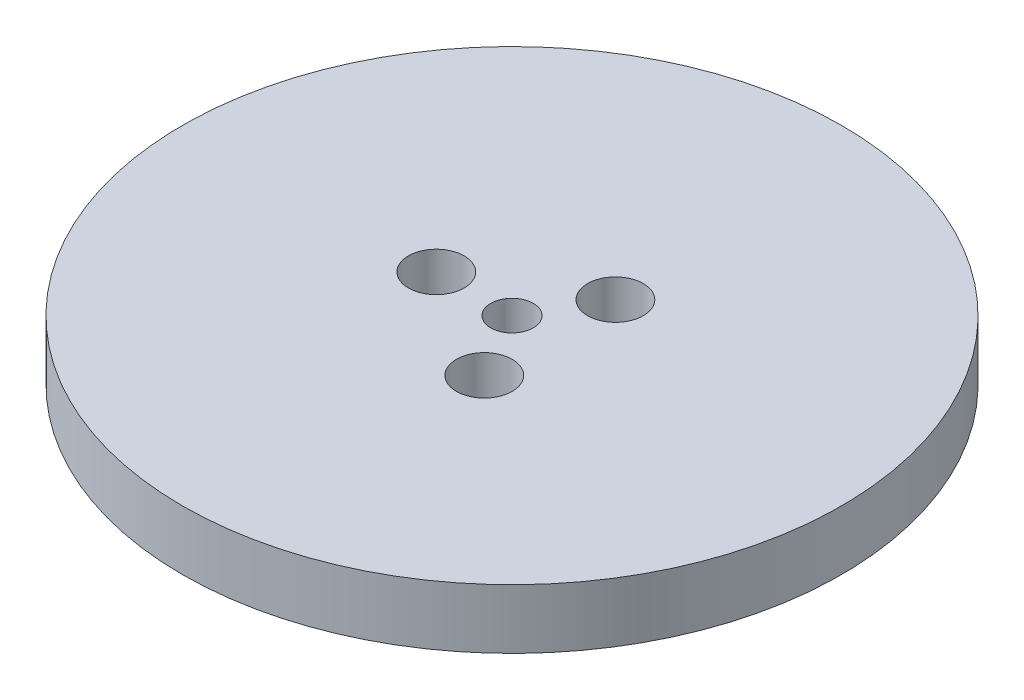
ISO-10303-21;
HEADER;
FILE_DESCRIPTION(('STEP AP214'),'2;1');
FILE_NAME('part.step','',(''),(''),'','','');
FILE_SCHEMA(('AUTOMOTIVE_DESIGN { 1 0 10303 214 1 1 1 1 }'));
ENDSEC;
DATA;
#1=APPLICATION_CONTEXT('core data for automotive mechanical design processes');
#2=APPLICATION_PROTOCOL_DEFINITION('international standard','automotive_design',2000,#1);
#3=PRODUCT_CONTEXT('',#1,'mechanical');
#4=PRODUCT('Part','Part','',(#3));
#5=PRODUCT_RELATED_PRODUCT_CATEGORY('part','',(#4));
#6=PRODUCT_DEFINITION_FORMATION('','',#4);
#7=PRODUCT_DEFINITION_CONTEXT('part definition',#1,'design');
#8=PRODUCT_DEFINITION('design','',#6,#7);
#9=PRODUCT_DEFINITION_SHAPE('','',#8);
#10=(LENGTH_UNIT() NAMED_UNIT(*) SI_UNIT(.MILLI.,.METRE.));
#11=(NAMED_UNIT(*) PLANE_ANGLE_UNIT() SI_UNIT($,.RADIAN.));
#12=(NAMED_UNIT(*) SI_UNIT($,.STERADIAN.) SOLID_ANGLE_UNIT());
#13=UNCERTAINTY_MEASURE_WITH_UNIT(LENGTH_MEASURE(1.E-05),#10,'distance_accuracy_value','');
#14=(GEOMETRIC_REPRESENTATION_CONTEXT(3) GLOBAL_UNCERTAINTY_ASSIGNED_CONTEXT((#13)) GLOBAL_UNIT_ASSIGNED_CONTEXT((#10,
#11,#12)) REPRESENTATION_CONTEXT('',''));
#15=CARTESIAN_POINT('',(0.,0.,0.));
#16=DIRECTION('',(0.,0.,1.));
#17=DIRECTION('',(1.,0.,0.));
#18=AXIS2_PLACEMENT_3D('',#15,#16,#17);
#19=CARTESIAN_POINT('',(0.,14.,0.));
#20=DIRECTION('',(0.,-1.,0.));
#21=DIRECTION('',(0.,0.,-1.));
#22=AXIS2_PLACEMENT_3D('',#19,#20,#21);
#23=CYLINDRICAL_SURFACE('',#22,77.5);
#24=CARTESIAN_POINT('',(0.,14.,0.));
#25=DIRECTION('',(0.,1.,0.));
#26=DIRECTION('',(0.,0.,1.));
#27=AXIS2_PLACEMENT_3D('',#24,#25,#26);
#28=CIRCLE('',#27,77.5);
#29=CARTESIAN_POINT('',(0.,14.,77.5));
#30=VERTEX_POINT('',#29);
#31=EDGE_CURVE('E10',#30,#30,#28,.T.);
#32=ORIENTED_EDGE('',*,*,#31,.F.);
#33=EDGE_LOOP('',(#32));
#34=FACE_BOUND('',#33,.T.);
#35=CARTESIAN_POINT('',(0.,0.,0.));
#36=DIRECTION('',(0.,1.,0.));
#37=DIRECTION('',(0.,0.,1.));
#38=AXIS2_PLACEMENT_3D('',#35,#36,#37);
#39=CIRCLE('',#38,77.5);
#40=CARTESIAN_POINT('',(0.,0.,77.5));
#41=VERTEX_POINT('',#40);
#42=EDGE_CURVE('E37',#41,#41,#39,.T.);
#43=ORIENTED_EDGE('',*,*,#42,.T.);
#44=EDGE_LOOP('',(#43));
#45=FACE_BOUND('',#44,.T.);
#46=ADVANCED_FACE('F40',(#34,#45),#23,.T.);
#47=CARTESIAN_POINT('',(0.,14.,0.));
#48=DIRECTION('',(0.,1.,0.));
#49=DIRECTION('',(0.,0.,1.));
#50=AXIS2_PLACEMENT_3D('',#47,#48,#49);
#51=PLANE('',#50);
#52=CARTESIAN_POINT('',(8.90197339307302,14.,15.4186702044286));
#53=DIRECTION('',(0.,1.,0.));
#54=DIRECTION('',(0.866025403784436,0.,-0.500000000000004));
#55=AXIS2_PLACEMENT_3D('',#52,#53,#54);
#56=CIRCLE('',#55,6.55427380083942);
#57=CARTESIAN_POINT('',(14.5781410079587,14.,12.1415333040089));
#58=VERTEX_POINT('',#57);
#59=EDGE_CURVE('E70',#58,#58,#56,.T.);
#60=ORIENTED_EDGE('',*,*,#59,.F.);
#61=EDGE_LOOP('',(#60));
#62=FACE_BOUND('',#61,.T.);
#63=CARTESIAN_POINT('',(8.9019733930728,14.,-15.4186702044287));
#64=DIRECTION('',(0.,1.,0.));
#65=DIRECTION('',(-0.866025403784443,0.,-0.499999999999992));
#66=AXIS2_PLACEMENT_3D('',#63,#64,#65);
#67=CIRCLE('',#66,6.55427380083942);
#68=CARTESIAN_POINT('',(3.22580577818705,14.,-18.6958071048484));
#69=VERTEX_POINT('',#68);
#70=EDGE_CURVE('E61',#69,#69,#67,.T.);
#71=ORIENTED_EDGE('',*,*,#70,.F.);
#72=EDGE_LOOP('',(#71));
#73=FACE_BOUND('',#72,.T.);
#74=CARTESIAN_POINT('',(-17.8039467861459,14.,0.));
#75=DIRECTION('',(0.,1.,0.));
#76=DIRECTION('',(0.,0.,1.));
#77=AXIS2_PLACEMENT_3D('',#74,#75,#76);
#78=CIRCLE('',#77,6.55427380083942);
#79=CARTESIAN_POINT('',(-17.8039467861459,14.,6.55427380083942));
#80=VERTEX_POINT('',#79);
#81=EDGE_CURVE('E54',#80,#80,#78,.T.);
#82=ORIENTED_EDGE('',*,*,#81,.F.);
#83=EDGE_LOOP('',(#82));
#84=FACE_BOUND('',#83,.T.);
#85=CARTESIAN_POINT('',(0.,14.,0.));
#86=DIRECTION('',(0.,1.,0.));
#87=DIRECTION('',(0.,0.,1.));
#88=AXIS2_PLACEMENT_3D('',#85,#86,#87);
#89=CIRCLE('',#88,5.);
#90=CARTESIAN_POINT('',(0.,14.,5.));
#91=VERTEX_POINT('',#90);
#92=EDGE_CURVE('E50',#91,#91,#89,.T.);
#93=ORIENTED_EDGE('',*,*,#92,.F.);
#94=EDGE_LOOP('',(#93));
#95=FACE_BOUND('',#94,.T.);
#96=ORIENTED_EDGE('',*,*,#31,.T.);
#97=EDGE_LOOP('',(#96));
#98=FACE_BOUND('',#97,.T.);
#99=ADVANCED_FACE('F85',(#62,#73,#84,#95,#98),#51,.T.);
#100=CARTESIAN_POINT('',(0.,0.,0.));
#101=DIRECTION('',(0.,1.,0.));
#102=DIRECTION('',(0.,0.,1.));
#103=AXIS2_PLACEMENT_3D('',#100,#101,#102);
#104=PLANE('',#103);
#105=CARTESIAN_POINT('',(0.,0.,0.));
#106=DIRECTION('',(0.,1.,0.));
#107=DIRECTION('',(0.,0.,1.));
#108=AXIS2_PLACEMENT_3D('',#105,#106,#107);
#109=CIRCLE('',#108,5.);
#110=CARTESIAN_POINT('',(0.,0.,5.));
#111=VERTEX_POINT('',#110);
#112=EDGE_CURVE('E47',#111,#111,#109,.T.);
#113=ORIENTED_EDGE('',*,*,#112,.T.);
#114=EDGE_LOOP('',(#113));
#115=FACE_BOUND('',#114,.T.);
#116=ORIENTED_EDGE('',*,*,#42,.F.);
#117=EDGE_LOOP('',(#116));
#118=FACE_BOUND('',#117,.T.);
#119=ADVANCED_FACE('F84',(#115,#118),#104,.F.);
#120=CARTESIAN_POINT('',(0.,14.,0.));
#121=DIRECTION('',(0.,-1.,0.));
#122=DIRECTION('',(0.,0.,-1.));
#123=AXIS2_PLACEMENT_3D('',#120,#121,#122);
#124=CYLINDRICAL_SURFACE('',#123,5.);
#125=ORIENTED_EDGE('',*,*,#92,.T.);
#126=EDGE_LOOP('',(#125));
#127=FACE_BOUND('',#126,.T.);
#128=ORIENTED_EDGE('',*,*,#112,.F.);
#129=EDGE_LOOP('',(#128));
#130=FACE_BOUND('',#129,.T.);
#131=ADVANCED_FACE('F91',(#127,#130),#124,.F.);
#132=CARTESIAN_POINT('',(-17.8039467861459,0.525690304775537,0.));
#133=DIRECTION('',(0.,1.,0.));
#134=DIRECTION('',(0.,0.,1.));
#135=AXIS2_PLACEMENT_3D('',#132,#133,#134);
#136=CYLINDRICAL_SURFACE('',#135,6.55427380083942);
#137=CARTESIAN_POINT('',(-17.8039467861459,0.525690304775537,0.));
#138=DIRECTION('',(0.,1.,0.));
#139=DIRECTION('',(0.,0.,1.));
#140=AXIS2_PLACEMENT_3D('',#137,#138,#139);
#141=CIRCLE('',#140,6.55427380083942);
#142=CARTESIAN_POINT('',(-17.8039467861459,0.525690304775537,6.55427380083942));
#143=VERTEX_POINT('',#142);
#144=EDGE_CURVE('E55',#143,#143,#141,.T.);
#145=ORIENTED_EDGE('',*,*,#144,.F.);
#146=EDGE_LOOP('',(#145));
#147=FACE_BOUND('',#146,.T.);
#148=ORIENTED_EDGE('',*,*,#81,.T.);
#149=EDGE_LOOP('',(#148));
#150=FACE_BOUND('',#149,.T.);
#151=ADVANCED_FACE('F96',(#147,#150),#136,.F.);
#152=CARTESIAN_POINT('',(-17.8039467861459,0.525690304775537,0.));
#153=DIRECTION('',(0.,1.,0.));
#154=DIRECTION('',(0.,0.,1.));
#155=AXIS2_PLACEMENT_3D('',#152,#153,#154);
#156=PLANE('',#155);
#157=ORIENTED_EDGE('',*,*,#144,.T.);
#158=EDGE_LOOP('',(#157));
#159=FACE_BOUND('',#158,.T.);
#160=ADVANCED_FACE('F127',(#159),#156,.T.);
#161=CARTESIAN_POINT('',(8.9019733930728,0.525690304775537,-15.4186702044287));
#162=DIRECTION('',(0.,1.,0.));
#163=DIRECTION('',(0.,0.,1.));
#164=AXIS2_PLACEMENT_3D('',#161,#162,#163);
#165=CYLINDRICAL_SURFACE('',#164,6.55427380083942);
#166=CARTESIAN_POINT('',(8.9019733930728,0.525690304775537,-15.4186702044287));
#167=DIRECTION('',(0.,1.,0.));
#168=DIRECTION('',(-0.866025403784443,0.,-0.499999999999992));
#169=AXIS2_PLACEMENT_3D('',#166,#167,#168);
#170=CIRCLE('',#169,6.55427380083942);
#171=CARTESIAN_POINT('',(3.22580577818705,0.525690304775537,-18.6958071048484));
#172=VERTEX_POINT('',#171);
#173=EDGE_CURVE('E63',#172,#172,#170,.T.);
#174=ORIENTED_EDGE('',*,*,#173,.F.);
#175=EDGE_LOOP('',(#174));
#176=FACE_BOUND('',#175,.T.);
#177=ORIENTED_EDGE('',*,*,#70,.T.);
#178=EDGE_LOOP('',(#177));
#179=FACE_BOUND('',#178,.T.);
#180=ADVANCED_FACE('F133',(#176,#179),#165,.F.);
#181=CARTESIAN_POINT('',(8.9019733930728,0.525690304775537,-15.4186702044287));
#182=DIRECTION('',(0.,1.,0.));
#183=DIRECTION('',(-0.866025403784443,0.,-0.499999999999992));
#184=AXIS2_PLACEMENT_3D('',#181,#182,#183);
#185=PLANE('',#184);
#186=ORIENTED_EDGE('',*,*,#173,.T.);
#187=EDGE_LOOP('',(#186));
#188=FACE_BOUND('',#187,.T.);
#189=ADVANCED_FACE('F77',(#188),#185,.T.);
#190=CARTESIAN_POINT('',(8.90197339307302,0.525690304775537,15.4186702044286));
#191=DIRECTION('',(0.,1.,0.));
#192=DIRECTION('',(0.,0.,1.));
#193=AXIS2_PLACEMENT_3D('',#190,#191,#192);
#194=CYLINDRICAL_SURFACE('',#193,6.55427380083942);
#195=CARTESIAN_POINT('',(8.90197339307302,0.525690304775537,15.4186702044286));
#196=DIRECTION('',(0.,1.,0.));
#197=DIRECTION('',(0.866025403784436,0.,-0.500000000000004));
#198=AXIS2_PLACEMENT_3D('',#195,#196,#197);
#199=CIRCLE('',#198,6.55427380083942);
#200=CARTESIAN_POINT('',(14.5781410079587,0.525690304775537,12.1415333040089));
#201=VERTEX_POINT('',#200);
#202=EDGE_CURVE('E59',#201,#201,#199,.T.);
#203=ORIENTED_EDGE('',*,*,#202,.F.);
#204=EDGE_LOOP('',(#203));
#205=FACE_BOUND('',#204,.T.);
#206=ORIENTED_EDGE('',*,*,#59,.T.);
#207=EDGE_LOOP('',(#206));
#208=FACE_BOUND('',#207,.T.);
#209=ADVANCED_FACE('F73',(#205,#208),#194,.F.);
#210=CARTESIAN_POINT('',(8.90197339307302,0.525690304775537,15.4186702044286));
#211=DIRECTION('',(0.,1.,0.));
#212=DIRECTION('',(0.866025403784436,0.,-0.500000000000004));
#213=AXIS2_PLACEMENT_3D('',#210,#211,#212);
#214=PLANE('',#213);
#215=ORIENTED_EDGE('',*,*,#202,.T.);
#216=EDGE_LOOP('',(#215));
#217=FACE_BOUND('',#216,.T.);
#218=ADVANCED_FACE('F71',(#217),#214,.T.);
#219=CLOSED_SHELL('',(#46,#99,#119,#131,#151,#160,#180,#189,#209,#218));
#220=MANIFOLD_SOLID_BREP('B2',#219);
#221=ADVANCED_BREP_SHAPE_REPRESENTATION('',(#18,#220),#14);
#222=SHAPE_DEFINITION_REPRESENTATION(#9,#221);
ENDSEC;
END-ISO-10303-21;
